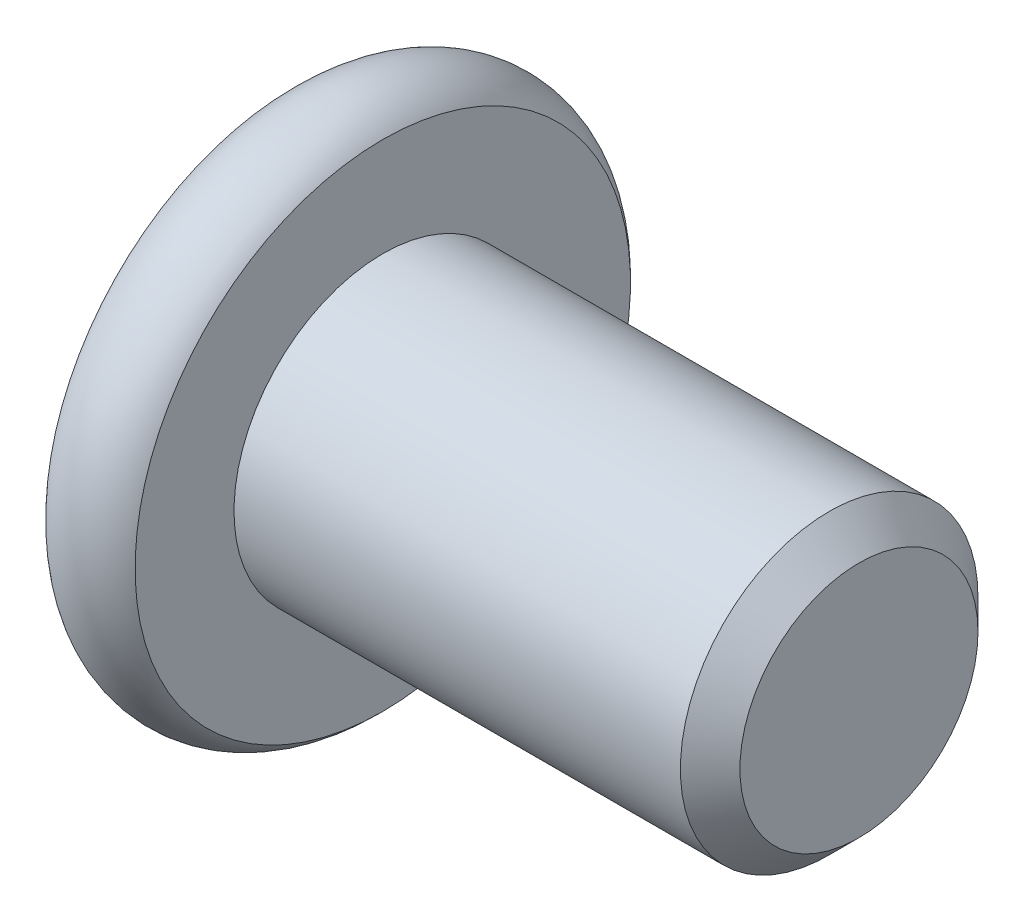
ISO-10303-21;
HEADER;
FILE_DESCRIPTION(('STEP AP214'),'2;1');
FILE_NAME('part.step','',(''),(''),'','','');
FILE_SCHEMA(('AUTOMOTIVE_DESIGN { 1 0 10303 214 1 1 1 1 }'));
ENDSEC;
DATA;
#1=APPLICATION_CONTEXT('core data for automotive mechanical design processes');
#2=APPLICATION_PROTOCOL_DEFINITION('international standard','automotive_design',2000,#1);
#3=PRODUCT_CONTEXT('',#1,'mechanical');
#4=PRODUCT('Part','Part','',(#3));
#5=PRODUCT_RELATED_PRODUCT_CATEGORY('part','',(#4));
#6=PRODUCT_DEFINITION_FORMATION('','',#4);
#7=PRODUCT_DEFINITION_CONTEXT('part definition',#1,'design');
#8=PRODUCT_DEFINITION('design','',#6,#7);
#9=PRODUCT_DEFINITION_SHAPE('','',#8);
#10=(LENGTH_UNIT() NAMED_UNIT(*) SI_UNIT(.MILLI.,.METRE.));
#11=(NAMED_UNIT(*) PLANE_ANGLE_UNIT() SI_UNIT($,.RADIAN.));
#12=(NAMED_UNIT(*) SI_UNIT($,.STERADIAN.) SOLID_ANGLE_UNIT());
#13=UNCERTAINTY_MEASURE_WITH_UNIT(LENGTH_MEASURE(1.E-05),#10,'distance_accuracy_value','');
#14=(GEOMETRIC_REPRESENTATION_CONTEXT(3) GLOBAL_UNCERTAINTY_ASSIGNED_CONTEXT((#13)) GLOBAL_UNIT_ASSIGNED_CONTEXT((#10,
#11,#12)) REPRESENTATION_CONTEXT('',''));
#15=CARTESIAN_POINT('',(0.,0.,0.));
#16=DIRECTION('',(0.,0.,1.));
#17=DIRECTION('',(1.,0.,0.));
#18=AXIS2_PLACEMENT_3D('',#15,#16,#17);
#19=CARTESIAN_POINT('',(-8.,0.,0.));
#20=DIRECTION('',(1.,0.,0.));
#21=DIRECTION('',(0.,0.,-1.));
#22=AXIS2_PLACEMENT_3D('',#19,#20,#21);
#23=CYLINDRICAL_SURFACE('',#22,2.5);
#24=CARTESIAN_POINT('',(-0.500000000000003,0.,0.));
#25=DIRECTION('',(1.,0.,0.));
#26=DIRECTION('',(0.,0.,-1.));
#27=AXIS2_PLACEMENT_3D('',#24,#25,#26);
#28=CIRCLE('',#27,2.5);
#29=CARTESIAN_POINT('',(-0.500000000000003,0.,-2.5));
#30=VERTEX_POINT('',#29);
#31=EDGE_CURVE('E45',#30,#30,#28,.F.);
#32=ORIENTED_EDGE('',*,*,#31,.T.);
#33=EDGE_LOOP('',(#32));
#34=FACE_BOUND('',#33,.T.);
#35=CARTESIAN_POINT('',(-8.,0.,0.));
#36=DIRECTION('',(1.,0.,0.));
#37=DIRECTION('',(0.,1.,0.));
#38=AXIS2_PLACEMENT_3D('',#35,#36,#37);
#39=CIRCLE('',#38,2.5);
#40=CARTESIAN_POINT('',(-8.,2.49999999999999,0.));
#41=VERTEX_POINT('',#40);
#42=EDGE_CURVE('E121',#41,#41,#39,.F.);
#43=ORIENTED_EDGE('',*,*,#42,.F.);
#44=EDGE_LOOP('',(#43));
#45=FACE_BOUND('',#44,.T.);
#46=ADVANCED_FACE('F32',(#34,#45),#23,.T.);
#47=CARTESIAN_POINT('',(0.,0.,0.));
#48=DIRECTION('',(1.,0.,0.));
#49=DIRECTION('',(0.,0.,-1.));
#50=AXIS2_PLACEMENT_3D('',#47,#48,#49);
#51=PLANE('',#50);
#52=CARTESIAN_POINT('',(0.,0.,0.));
#53=DIRECTION('',(1.,0.,0.));
#54=DIRECTION('',(0.,0.,-1.));
#55=AXIS2_PLACEMENT_3D('',#52,#53,#54);
#56=CIRCLE('',#55,2.);
#57=CARTESIAN_POINT('',(0.,0.,-2.));
#58=VERTEX_POINT('',#57);
#59=EDGE_CURVE('E124',#58,#58,#56,.T.);
#60=ORIENTED_EDGE('',*,*,#59,.T.);
#61=EDGE_LOOP('',(#60));
#62=FACE_BOUND('',#61,.T.);
#63=ADVANCED_FACE('F134',(#62),#51,.T.);
#64=CARTESIAN_POINT('',(0.,0.,0.));
#65=DIRECTION('',(-1.,0.,0.));
#66=DIRECTION('',(0.,0.,1.));
#67=AXIS2_PLACEMENT_3D('',#64,#65,#66);
#68=CONICAL_SURFACE('',#67,2.,0.785398163397447);
#69=ORIENTED_EDGE('',*,*,#31,.F.);
#70=EDGE_LOOP('',(#69));
#71=FACE_BOUND('',#70,.T.);
#72=ORIENTED_EDGE('',*,*,#59,.F.);
#73=EDGE_LOOP('',(#72));
#74=FACE_BOUND('',#73,.T.);
#75=ADVANCED_FACE('F34',(#71,#74),#68,.T.);
#76=CARTESIAN_POINT('',(-9.5,0.,0.));
#77=DIRECTION('',(-1.,0.,0.));
#78=DIRECTION('',(0.,-1.,0.));
#79=AXIS2_PLACEMENT_3D('',#76,#77,#78);
#80=PLANE('',#79);
#81=CARTESIAN_POINT('',(-9.5,0.,0.));
#82=DIRECTION('',(-1.,0.,0.));
#83=DIRECTION('',(0.,-1.,0.));
#84=AXIS2_PLACEMENT_3D('',#81,#82,#83);
#85=CIRCLE('',#84,1.78205080756887);
#86=CARTESIAN_POINT('',(-9.50000000000001,-1.78205080756883,0.));
#87=VERTEX_POINT('',#86);
#88=EDGE_CURVE('E234',#87,#87,#85,.T.);
#89=ORIENTED_EDGE('',*,*,#88,.F.);
#90=EDGE_LOOP('',(#89));
#91=FACE_BOUND('',#90,.T.);
#92=CARTESIAN_POINT('',(-9.49999999999999,0.,0.));
#93=DIRECTION('',(1.,0.,0.));
#94=DIRECTION('',(0.,1.,0.));
#95=AXIS2_PLACEMENT_3D('',#92,#93,#94);
#96=CIRCLE('',#95,4.16143782776615);
#97=CARTESIAN_POINT('',(-9.5,4.16143782776615,0.));
#98=VERTEX_POINT('',#97);
#99=EDGE_CURVE('E118',#98,#98,#96,.T.);
#100=ORIENTED_EDGE('',*,*,#99,.F.);
#101=EDGE_LOOP('',(#100));
#102=FACE_BOUND('',#101,.T.);
#103=ADVANCED_FACE('F133',(#91,#102),#80,.T.);
#104=CARTESIAN_POINT('',(-8.75,0.,0.));
#105=DIRECTION('',(1.,0.,0.));
#106=DIRECTION('',(0.,1.,0.));
#107=AXIS2_PLACEMENT_3D('',#104,#105,#106);
#108=TOROIDAL_SURFACE('',#107,3.5,1.);
#109=ORIENTED_EDGE('',*,*,#99,.T.);
#110=EDGE_LOOP('',(#109));
#111=FACE_BOUND('',#110,.T.);
#112=CARTESIAN_POINT('',(-8.,0.,0.));
#113=DIRECTION('',(1.,0.,0.));
#114=DIRECTION('',(0.,1.,0.));
#115=AXIS2_PLACEMENT_3D('',#112,#113,#114);
#116=CIRCLE('',#115,4.16143782776615);
#117=CARTESIAN_POINT('',(-8.,4.16143782776615,0.));
#118=VERTEX_POINT('',#117);
#119=EDGE_CURVE('E115',#118,#118,#116,.T.);
#120=ORIENTED_EDGE('',*,*,#119,.F.);
#121=EDGE_LOOP('',(#120));
#122=FACE_BOUND('',#121,.T.);
#123=ADVANCED_FACE('F145',(#111,#122),#108,.T.);
#124=CARTESIAN_POINT('',(-8.,4.16143782776615,0.));
#125=DIRECTION('',(1.,0.,0.));
#126=DIRECTION('',(0.,1.,0.));
#127=AXIS2_PLACEMENT_3D('',#124,#125,#126);
#128=PLANE('',#127);
#129=ORIENTED_EDGE('',*,*,#42,.T.);
#130=EDGE_LOOP('',(#129));
#131=FACE_BOUND('',#130,.T.);
#132=ORIENTED_EDGE('',*,*,#119,.T.);
#133=EDGE_LOOP('',(#132));
#134=FACE_BOUND('',#133,.T.);
#135=ADVANCED_FACE('F149',(#131,#134),#128,.T.);
#136=CARTESIAN_POINT('',(-9.5,0.,0.));
#137=DIRECTION('',(-1.,0.,0.));
#138=DIRECTION('',(0.,-1.,0.));
#139=AXIS2_PLACEMENT_3D('',#136,#137,#138);
#140=CONICAL_SURFACE('',#139,1.78205080756887,0.78539816339745);
#141=ORIENTED_EDGE('',*,*,#88,.T.);
#142=EDGE_LOOP('',(#141));
#143=FACE_BOUND('',#142,.T.);
#144=CARTESIAN_POINT('',(-10.015428085613,-1.74023253176578,1.5));
#145=CARTESIAN_POINT('',(-9.98338110734452,-1.69791724929732,1.5));
#146=CARTESIAN_POINT('',(-9.95164446728406,-1.65536760966793,1.5));
#147=CARTESIAN_POINT('',(-9.88892039361529,-1.56970398156686,1.5));
#148=CARTESIAN_POINT('',(-9.85793314821998,-1.5265898554285,1.5));
#149=CARTESIAN_POINT('',(-9.76584616434498,-1.39562626326564,1.5));
#150=CARTESIAN_POINT('',(-9.70611451230213,-1.30679868010577,1.5));
#151=CARTESIAN_POINT('',(-9.58873428910123,-1.12044622640216,1.5));
#152=CARTESIAN_POINT('',(-9.53140827748225,-1.02271587306674,1.5));
#153=CARTESIAN_POINT('',(-9.42646321497595,-0.822357214965266,1.5));
#154=CARTESIAN_POINT('',(-9.37881142368962,-0.719746931701929,1.5));
#155=CARTESIAN_POINT('',(-9.32050998831503,-0.565852387095102,1.5));
#156=CARTESIAN_POINT('',(-9.30379905354091,-0.51687419142469,1.5));
#157=CARTESIAN_POINT('',(-9.2743077515089,-0.417723988457528,1.5));
#158=CARTESIAN_POINT('',(-9.26152765142192,-0.367551900263895,1.5));
#159=CARTESIAN_POINT('',(-9.24077842024577,-0.267158299056145,1.5));
#160=CARTESIAN_POINT('',(-9.23272606182593,-0.216954261864881,1.5));
#161=CARTESIAN_POINT('',(-9.22159163683403,-0.115994915871346,1.5));
#162=CARTESIAN_POINT('',(-9.21850868863769,-0.0652397064615639,1.5));
#163=CARTESIAN_POINT('',(-9.21754738974037,0.0344222234875322,1.5));
#164=CARTESIAN_POINT('',(-9.21947892169515,0.0833271701100663,1.5));
#165=CARTESIAN_POINT('',(-9.22801757296766,0.180724293127199,1.5));
#166=CARTESIAN_POINT('',(-9.23462514204802,0.229216429361706,1.5));
#167=CARTESIAN_POINT('',(-9.25226506264468,0.326258027696986,1.5));
#168=CARTESIAN_POINT('',(-9.26337316820096,0.374793507450006,1.5));
#169=CARTESIAN_POINT('',(-9.28941986695951,0.470802295834161,1.5));
#170=CARTESIAN_POINT('',(-9.30435815600349,0.518275688481264,1.5));
#171=CARTESIAN_POINT('',(-9.35683954571596,0.667150562065113,1.5));
#172=CARTESIAN_POINT('',(-9.40033511654416,0.766448362426832,1.5));
#173=CARTESIAN_POINT('',(-9.49705878148361,0.960384405673818,1.5));
#174=CARTESIAN_POINT('',(-9.55032172266746,1.05500437383619,1.5));
#175=CARTESIAN_POINT('',(-9.66022580104533,1.2358452032153,1.5));
#176=CARTESIAN_POINT('',(-9.7165682531046,1.32224986946548,1.5));
#177=CARTESIAN_POINT('',(-9.80367557259701,1.44954953726471,1.5));
#178=CARTESIAN_POINT('',(-9.83301999068387,1.49143368482421,1.5));
#179=CARTESIAN_POINT('',(-9.89248691829305,1.57462914783242,1.5));
#180=CARTESIAN_POINT('',(-9.92260921150072,1.61594061772577,1.5));
#181=CARTESIAN_POINT('',(-9.95305411813654,1.65701358742551,1.5));
#182=B_SPLINE_CURVE_WITH_KNOTS('',3,(#144,#145,#146,#147,#148,#149,#150,#151,#152,#153,#154,
#155,#156,#157,#158,#159,#160,#161,#162,#163,#164,#165,#166,#167,#168,#169,#170,#171,#172,#173,
#174,#175,#176,#177,#178,#179,#180,#181),.UNSPECIFIED.,.F.,.F.,(4,2,2,2,2,2,2,2,2,2,2,2,2,2,2,2,
2,2,4),(0.,0.159238974218355,0.318517535014544,0.639504781932389,0.9791378937992,
1.31760168934357,1.47272233841624,1.62785352839776,1.78016486537347,1.93244917778279,
2.07904486260298,2.22565464958333,2.37484213303399,2.5240177730404,2.84828365283776,
3.1737297566675,3.48303030530537,3.63644667013909,3.78982082222913),.UNSPECIFIED.);
#183=CARTESIAN_POINT('',(-9.45000000000001,-0.866025403784403,1.5));
#184=VERTEX_POINT('',#183);
#185=CARTESIAN_POINT('',(-9.45,0.866025403784475,1.5));
#186=VERTEX_POINT('',#185);
#187=EDGE_CURVE('E99',#184,#186,#182,.T.);
#188=ORIENTED_EDGE('',*,*,#187,.F.);
#189=CARTESIAN_POINT('',(-9.45011548160009,-1.73216627762268,-0.000200000000000452));
#190=CARTESIAN_POINT('',(-9.42036547606734,-1.70239359975911,0.0513677907370754));
#191=CARTESIAN_POINT('',(-9.39236248391033,-1.67212305186351,0.103797917665201));
#192=CARTESIAN_POINT('',(-9.34108923044016,-1.61039789003616,0.210709034055596));
#193=CARTESIAN_POINT('',(-9.31784750504439,-1.5789374031261,0.265200195814661));
#194=CARTESIAN_POINT('',(-9.27803372899223,-1.51549879897984,0.375079081357249));
#195=CARTESIAN_POINT('',(-9.26136158567091,-1.48353684526807,0.4304388090952));
#196=CARTESIAN_POINT('',(-9.23567445681812,-1.41890915196208,0.542377257477151));
#197=CARTESIAN_POINT('',(-9.22664029047888,-1.38624538781115,0.598952556553009));
#198=CARTESIAN_POINT('',(-9.21848908122687,-1.32995210095296,0.696455389516441));
#199=CARTESIAN_POINT('',(-9.21728225298923,-1.3063953331112,0.737256908280466));
#200=CARTESIAN_POINT('',(-9.21931405716228,-1.2593233529019,0.818787969615858));
#201=CARTESIAN_POINT('',(-9.22255367074832,-1.2358081508531,0.85951749431463));
#202=CARTESIAN_POINT('',(-9.23329198598198,-1.18900414978423,0.940584402163416));
#203=CARTESIAN_POINT('',(-9.24079465301875,-1.16571558211716,0.980921384598288));
#204=CARTESIAN_POINT('',(-9.2596516119283,-1.11952932016332,1.06091833691403));
#205=CARTESIAN_POINT('',(-9.2710075570186,-1.09663179808783,1.10057800851621));
#206=CARTESIAN_POINT('',(-9.30472164759268,-1.03798159809695,1.20216313477448));
#207=CARTESIAN_POINT('',(-9.32962184909338,-1.00259267147462,1.26345855370969));
#208=CARTESIAN_POINT('',(-9.37165665327159,-0.950557780604339,1.35358562846331));
#209=CARTESIAN_POINT('',(-9.38642515355911,-0.933410759677112,1.38328513990772));
#210=CARTESIAN_POINT('',(-9.41731056594018,-0.899432101996371,1.44213790138375));
#211=CARTESIAN_POINT('',(-9.43342683412172,-0.882600319285674,1.47129140422064));
#212=CARTESIAN_POINT('',(-9.45011548160008,-0.865909933730565,1.5002));
#213=B_SPLINE_CURVE_WITH_KNOTS('',3,(#189,#190,#191,#192,#193,#194,#195,#196,#197,#198,#199,
#200,#201,#202,#203,#204,#205,#206,#207,#208,#209,#210,#211,#212),.UNSPECIFIED.,.F.,.F.,(4,2,2,
2,2,2,2,2,2,2,2,4),(0.,0.199829143693305,0.400822987382389,0.598623720538182,0.79592624018889,
0.937113067959882,1.07833105577193,1.21968061668222,1.36109089931054,1.58570969637565,
1.69770705470963,1.80965120737194),.UNSPECIFIED.);
#214=CARTESIAN_POINT('',(-9.45000000000002,-1.73205080756884,0.));
#215=VERTEX_POINT('',#214);
#216=EDGE_CURVE('E191',#215,#184,#213,.T.);
#217=ORIENTED_EDGE('',*,*,#216,.F.);
#218=CARTESIAN_POINT('',(-9.45011548160008,-0.865909933730564,-1.5002));
#219=CARTESIAN_POINT('',(-9.42036547606734,-0.895682611594129,-1.44863220926292));
#220=CARTESIAN_POINT('',(-9.39236248391033,-0.925953159489728,-1.3962020823348));
#221=CARTESIAN_POINT('',(-9.34108923044015,-0.987678321317087,-1.2892909659444));
#222=CARTESIAN_POINT('',(-9.31784750504438,-1.01913880822714,-1.23479980418534));
#223=CARTESIAN_POINT('',(-9.27803372899223,-1.08257741237341,-1.12492091864275));
#224=CARTESIAN_POINT('',(-9.26136158567091,-1.11453936608518,-1.0695611909048));
#225=CARTESIAN_POINT('',(-9.23567445681812,-1.17916705939117,-0.957622742522849));
#226=CARTESIAN_POINT('',(-9.22664029047888,-1.2118308235421,-0.901047443446991));
#227=CARTESIAN_POINT('',(-9.21848908122687,-1.26812411040029,-0.803544610483559));
#228=CARTESIAN_POINT('',(-9.21728225298923,-1.29168087824204,-0.762743091719534));
#229=CARTESIAN_POINT('',(-9.21931405716228,-1.33875285845135,-0.681212030384142));
#230=CARTESIAN_POINT('',(-9.22255367074832,-1.36226806050015,-0.64048250568537));
#231=CARTESIAN_POINT('',(-9.23329198598198,-1.40907206156901,-0.559415597836584));
#232=CARTESIAN_POINT('',(-9.24079465301875,-1.43236062923609,-0.519078615401712));
#233=CARTESIAN_POINT('',(-9.25965161192831,-1.47854689118993,-0.439081663085969));
#234=CARTESIAN_POINT('',(-9.2710075570186,-1.50144441326542,-0.399421991483792));
#235=CARTESIAN_POINT('',(-9.30472164759269,-1.5600946132563,-0.297836865225516));
#236=CARTESIAN_POINT('',(-9.32962184909338,-1.59548353987863,-0.236541446290312));
#237=CARTESIAN_POINT('',(-9.37165665327159,-1.6475184307489,-0.146414371536688));
#238=CARTESIAN_POINT('',(-9.38642515355911,-1.66466545167613,-0.116714860092283));
#239=CARTESIAN_POINT('',(-9.41731056594018,-1.69864410935687,-0.0578620986162504));
#240=CARTESIAN_POINT('',(-9.43342683412173,-1.71547589206757,-0.0287085957793641));
#241=CARTESIAN_POINT('',(-9.45011548160009,-1.73216627762268,0.00019999999999879));
#242=B_SPLINE_CURVE_WITH_KNOTS('',3,(#218,#219,#220,#221,#222,#223,#224,#225,#226,#227,#228,
#229,#230,#231,#232,#233,#234,#235,#236,#237,#238,#239,#240,#241),.UNSPECIFIED.,.F.,.F.,(4,2,2,
2,2,2,2,2,2,2,2,4),(0.,0.199829143693305,0.400822987382388,0.59862372053818,0.795926240188889,
0.937113067959881,1.07833105577193,1.21968061668222,1.36109089931054,1.58570969637565,
1.69770705470963,1.80965120737193),.UNSPECIFIED.);
#243=CARTESIAN_POINT('',(-9.45000000000001,-0.866025403784402,-1.5));
#244=VERTEX_POINT('',#243);
#245=EDGE_CURVE('E186',#244,#215,#242,.T.);
#246=ORIENTED_EDGE('',*,*,#245,.F.);
#247=CARTESIAN_POINT('',(-10.0154280857208,-1.74023253190811,-1.5));
#248=CARTESIAN_POINT('',(-9.98338110744817,-1.69791724943563,-1.5));
#249=CARTESIAN_POINT('',(-9.95164446738356,-1.65536760980222,-1.5));
#250=CARTESIAN_POINT('',(-9.88892039370652,-1.56970398169306,-1.5));
#251=CARTESIAN_POINT('',(-9.85793314830708,-1.52658985555063,-1.5));
#252=CARTESIAN_POINT('',(-9.76584616441962,-1.39562626337533,-1.5));
#253=CARTESIAN_POINT('',(-9.70611451236851,-1.30679868020699,-1.5));
#254=CARTESIAN_POINT('',(-9.58873428915059,-1.12044622648493,-1.5));
#255=CARTESIAN_POINT('',(-9.53140827752291,-1.02271587313946,-1.5));
#256=CARTESIAN_POINT('',(-9.42646321500052,-0.822357215017054,-1.5));
#257=CARTESIAN_POINT('',(-9.37881142370675,-0.719746931742828,-1.5));
#258=CARTESIAN_POINT('',(-9.32050998832668,-0.565852387127819,-1.5));
#259=CARTESIAN_POINT('',(-9.3037990535528,-0.516874191460854,-1.5));
#260=CARTESIAN_POINT('',(-9.2743077515206,-0.417723988500702,-1.5));
#261=CARTESIAN_POINT('',(-9.26152765143317,-0.367551900310631,-1.5));
#262=CARTESIAN_POINT('',(-9.24077842025532,-0.267158299109892,-1.5));
#263=CARTESIAN_POINT('',(-9.23272606183424,-0.216954261922073,-1.5));
#264=CARTESIAN_POINT('',(-9.22159163683908,-0.115994915935318,-1.5));
#265=CARTESIAN_POINT('',(-9.21850868864072,-0.0652397065288689,-1.5));
#266=CARTESIAN_POINT('',(-9.21754738973878,0.0344222234141582,-1.5));
#267=CARTESIAN_POINT('',(-9.219478921691,0.0833271700339485,-1.5));
#268=CARTESIAN_POINT('',(-9.228017572958,0.180724293045873,-1.5));
#269=CARTESIAN_POINT('',(-9.23462514203542,0.229216429277917,-1.5));
#270=CARTESIAN_POINT('',(-9.25226506262589,0.326258027608331,-1.5));
#271=CARTESIAN_POINT('',(-9.26337316817892,0.374793507358959,-1.5));
#272=CARTESIAN_POINT('',(-9.28941986693092,0.470802295738562,-1.5));
#273=CARTESIAN_POINT('',(-9.30435815597158,0.518275688383507,-1.5));
#274=CARTESIAN_POINT('',(-9.35683954566847,0.667150561946159,-1.5));
#275=CARTESIAN_POINT('',(-9.40033511648235,0.766448362289902,-1.5));
#276=CARTESIAN_POINT('',(-9.49705878139156,0.960384405502316,-1.5));
#277=CARTESIAN_POINT('',(-9.55032172255949,1.0550043736481,-1.5));
#278=CARTESIAN_POINT('',(-9.6602258009069,1.2358452029974,-1.5));
#279=CARTESIAN_POINT('',(-9.71656825295176,1.32224986923424,-1.5));
#280=CARTESIAN_POINT('',(-9.80367557242263,1.44954953701376,-1.5));
#281=CARTESIAN_POINT('',(-9.83301999050237,1.49143368456679,-1.5));
#282=CARTESIAN_POINT('',(-9.89248691809731,1.57462914756209,-1.5));
#283=CARTESIAN_POINT('',(-9.92260921129787,1.615940617449,-1.5));
#284=CARTESIAN_POINT('',(-9.95305411792659,1.65701358714231,-1.5));
#285=B_SPLINE_CURVE_WITH_KNOTS('',3,(#247,#248,#249,#250,#251,#252,#253,#254,#255,#256,#257,
#258,#259,#260,#261,#262,#263,#264,#265,#266,#267,#268,#269,#270,#271,#272,#273,#274,#275,#276,
#277,#278,#279,#280,#281,#282,#283,#284),.UNSPECIFIED.,.F.,.F.,(4,2,2,2,2,2,2,2,2,2,2,2,2,2,2,2,
2,2,4),(0.,0.15923897423548,0.318517535048798,0.639504782001543,0.979137893907512,
1.31760168949067,1.47272233855335,1.62785352852489,1.78016486549104,1.93244917789081,
2.0790448627025,2.22565464967435,2.37484213311585,2.52401777311309,2.8482836528441,
3.17372975660706,3.4830303051878,3.63644666999335,3.78982082205521),.UNSPECIFIED.);
#286=CARTESIAN_POINT('',(-9.45,0.866025403784475,-1.5));
#287=VERTEX_POINT('',#286);
#288=EDGE_CURVE('E52',#287,#244,#285,.F.);
#289=ORIENTED_EDGE('',*,*,#288,.F.);
#290=CARTESIAN_POINT('',(-9.45011548160008,1.73216627762275,0.000200000000000217));
#291=CARTESIAN_POINT('',(-9.42036547606733,1.70239359975919,-0.0513677907370752));
#292=CARTESIAN_POINT('',(-9.39236248391032,1.67212305186359,-0.1037979176652));
#293=CARTESIAN_POINT('',(-9.34108923044015,1.61039789003623,-0.210709034055596));
#294=CARTESIAN_POINT('',(-9.31784750504437,1.57893740312618,-0.265200195814661));
#295=CARTESIAN_POINT('',(-9.27803372899222,1.51549879897991,-0.375079081357249));
#296=CARTESIAN_POINT('',(-9.2613615856709,1.48353684526814,-0.4304388090952));
#297=CARTESIAN_POINT('',(-9.23567445681811,1.41890915196215,-0.54237725747715));
#298=CARTESIAN_POINT('',(-9.22664029047887,1.38624538781122,-0.598952556553008));
#299=CARTESIAN_POINT('',(-9.21848908122685,1.32995210095303,-0.69645538951644));
#300=CARTESIAN_POINT('',(-9.21728225298922,1.30639533311127,-0.737256908280465));
#301=CARTESIAN_POINT('',(-9.21931405716227,1.25932335290197,-0.818787969615857));
#302=CARTESIAN_POINT('',(-9.22255367074831,1.23580815085317,-0.859517494314629));
#303=CARTESIAN_POINT('',(-9.23329198598197,1.1890041497843,-0.940584402163415));
#304=CARTESIAN_POINT('',(-9.24079465301874,1.16571558211723,-0.980921384598288));
#305=CARTESIAN_POINT('',(-9.25965161192829,1.11952932016339,-1.06091833691403));
#306=CARTESIAN_POINT('',(-9.27100755701859,1.0966317980879,-1.10057800851621));
#307=CARTESIAN_POINT('',(-9.30472164759268,1.03798159809702,-1.20216313477448));
#308=CARTESIAN_POINT('',(-9.32962184909337,1.00259267147469,-1.26345855370969));
#309=CARTESIAN_POINT('',(-9.37165665327158,0.950557780604411,-1.35358562846331));
#310=CARTESIAN_POINT('',(-9.3864251535591,0.933410759677184,-1.38328513990772));
#311=CARTESIAN_POINT('',(-9.41731056594018,0.899432101996444,-1.44213790138375));
#312=CARTESIAN_POINT('',(-9.43342683412172,0.882600319285747,-1.47129140422064));
#313=CARTESIAN_POINT('',(-9.45011548160008,0.865909933730638,-1.5002));
#314=B_SPLINE_CURVE_WITH_KNOTS('',3,(#290,#291,#292,#293,#294,#295,#296,#297,#298,#299,#300,
#301,#302,#303,#304,#305,#306,#307,#308,#309,#310,#311,#312,#313),.UNSPECIFIED.,.F.,.F.,(4,2,2,
2,2,2,2,2,2,2,2,4),(0.,0.199829143693304,0.400822987382389,0.598623720538181,0.795926240188888,
0.93711306795988,1.07833105577193,1.21968061668222,1.36109089931054,1.58570969637565,
1.69770705470964,1.80965120737194),.UNSPECIFIED.);
#315=CARTESIAN_POINT('',(-9.45,1.73205080756891,0.));
#316=VERTEX_POINT('',#315);
#317=EDGE_CURVE('E11',#316,#287,#314,.T.);
#318=ORIENTED_EDGE('',*,*,#317,.F.);
#319=CARTESIAN_POINT('',(-9.45011548160008,0.865909933730637,1.5002));
#320=CARTESIAN_POINT('',(-9.42036547606733,0.895682611594202,1.44863220926292));
#321=CARTESIAN_POINT('',(-9.39236248391032,0.925953159489801,1.3962020823348));
#322=CARTESIAN_POINT('',(-9.34108923044015,0.987678321317159,1.2892909659444));
#323=CARTESIAN_POINT('',(-9.31784750504438,1.01913880822721,1.23479980418534));
#324=CARTESIAN_POINT('',(-9.27803372899223,1.08257741237348,1.12492091864275));
#325=CARTESIAN_POINT('',(-9.2613615856709,1.11453936608525,1.0695611909048));
#326=CARTESIAN_POINT('',(-9.23567445681811,1.17916705939124,0.957622742522849));
#327=CARTESIAN_POINT('',(-9.22664029047887,1.21183082354217,0.901047443446991));
#328=CARTESIAN_POINT('',(-9.21848908122686,1.26812411040036,0.803544610483559));
#329=CARTESIAN_POINT('',(-9.21728225298922,1.29168087824211,0.762743091719534));
#330=CARTESIAN_POINT('',(-9.21931405716227,1.33875285845142,0.681212030384142));
#331=CARTESIAN_POINT('',(-9.22255367074831,1.36226806050022,0.64048250568537));
#332=CARTESIAN_POINT('',(-9.23329198598197,1.40907206156909,0.559415597836584));
#333=CARTESIAN_POINT('',(-9.24079465301874,1.43236062923616,0.519078615401712));
#334=CARTESIAN_POINT('',(-9.25965161192829,1.47854689119,0.439081663085969));
#335=CARTESIAN_POINT('',(-9.27100755701859,1.50144441326549,0.399421991483792));
#336=CARTESIAN_POINT('',(-9.30472164759268,1.56009461325637,0.297836865225515));
#337=CARTESIAN_POINT('',(-9.32962184909337,1.5954835398787,0.236541446290311));
#338=CARTESIAN_POINT('',(-9.37165665327158,1.64751843074898,0.146414371536686));
#339=CARTESIAN_POINT('',(-9.3864251535591,1.6646654516762,0.116714860092282));
#340=CARTESIAN_POINT('',(-9.41731056594017,1.69864410935694,0.0578620986162492));
#341=CARTESIAN_POINT('',(-9.43342683412171,1.71547589206764,0.028708595779363));
#342=CARTESIAN_POINT('',(-9.45011548160008,1.73216627762275,-0.000199999999999785));
#343=B_SPLINE_CURVE_WITH_KNOTS('',3,(#319,#320,#321,#322,#323,#324,#325,#326,#327,#328,#329,
#330,#331,#332,#333,#334,#335,#336,#337,#338,#339,#340,#341,#342),.UNSPECIFIED.,.F.,.F.,(4,2,2,
2,2,2,2,2,2,2,2,4),(0.,0.199829143693305,0.400822987382389,0.598623720538181,0.795926240188889,
0.937113067959881,1.07833105577193,1.21968061668222,1.36109089931054,1.58570969637565,
1.69770705470964,1.80965120737194),.UNSPECIFIED.);
#344=EDGE_CURVE('E90',#186,#316,#343,.T.);
#345=ORIENTED_EDGE('',*,*,#344,.F.);
#346=EDGE_LOOP('',(#188,#217,#246,#289,#318,#345));
#347=FACE_BOUND('',#346,.T.);
#348=ADVANCED_FACE('F89',(#143,#347),#140,.F.);
#349=CARTESIAN_POINT('',(-7.2,0.,0.));
#350=DIRECTION('',(-1.,0.,0.));
#351=DIRECTION('',(0.,-1.,0.));
#352=AXIS2_PLACEMENT_3D('',#349,#350,#351);
#353=PLANE('',#352);
#354=DIRECTION('',(0.,0.5,-0.866025403784439));
#355=VECTOR('',#354,1.);
#356=CARTESIAN_POINT('',(-7.19999999999999,0.866025403784466,1.5));
#357=LINE('',#356,#355);
#358=CARTESIAN_POINT('',(-7.19999999999999,0.866025403784466,1.5));
#359=VERTEX_POINT('',#358);
#360=CARTESIAN_POINT('',(-7.19999999999999,1.7320508075689,0.));
#361=VERTEX_POINT('',#360);
#362=EDGE_CURVE('E98',#359,#361,#357,.T.);
#363=ORIENTED_EDGE('',*,*,#362,.T.);
#364=DIRECTION('',(0.,-0.5,-0.866025403784439));
#365=VECTOR('',#364,1.);
#366=CARTESIAN_POINT('',(-7.19999999999999,1.7320508075689,0.));
#367=LINE('',#366,#365);
#368=CARTESIAN_POINT('',(-7.19999999999999,0.866025403784467,-1.5));
#369=VERTEX_POINT('',#368);
#370=EDGE_CURVE('E103',#361,#369,#367,.T.);
#371=ORIENTED_EDGE('',*,*,#370,.T.);
#372=DIRECTION('',(0.,-1.,0.));
#373=VECTOR('',#372,1.);
#374=CARTESIAN_POINT('',(-7.19999999999999,0.866025403784467,-1.5));
#375=LINE('',#374,#373);
#376=CARTESIAN_POINT('',(-7.2,-0.86602540378441,-1.5));
#377=VERTEX_POINT('',#376);
#378=EDGE_CURVE('E216',#369,#377,#375,.T.);
#379=ORIENTED_EDGE('',*,*,#378,.T.);
#380=DIRECTION('',(0.,-0.5,0.866025403784438));
#381=VECTOR('',#380,1.);
#382=CARTESIAN_POINT('',(-7.2,-0.86602540378441,-1.5));
#383=LINE('',#382,#381);
#384=CARTESIAN_POINT('',(-7.2,-1.73205080756885,0.));
#385=VERTEX_POINT('',#384);
#386=EDGE_CURVE('E220',#377,#385,#383,.T.);
#387=ORIENTED_EDGE('',*,*,#386,.T.);
#388=DIRECTION('',(0.,0.5,0.866025403784439));
#389=VECTOR('',#388,1.);
#390=CARTESIAN_POINT('',(-7.2,-1.73205080756885,0.));
#391=LINE('',#390,#389);
#392=CARTESIAN_POINT('',(-7.2,-0.866025403784411,1.5));
#393=VERTEX_POINT('',#392);
#394=EDGE_CURVE('E111',#385,#393,#391,.T.);
#395=ORIENTED_EDGE('',*,*,#394,.T.);
#396=DIRECTION('',(0.,1.,0.));
#397=VECTOR('',#396,1.);
#398=CARTESIAN_POINT('',(-7.2,-0.866025403784411,1.5));
#399=LINE('',#398,#397);
#400=EDGE_CURVE('E106',#393,#359,#399,.T.);
#401=ORIENTED_EDGE('',*,*,#400,.T.);
#402=EDGE_LOOP('',(#363,#371,#379,#387,#395,#401));
#403=FACE_BOUND('',#402,.T.);
#404=ADVANCED_FACE('F173',(#403),#353,.T.);
#405=CARTESIAN_POINT('',(-7.19999999999999,1.7320508075689,0.));
#406=DIRECTION('',(0.,0.866025403784439,-0.5));
#407=DIRECTION('',(0.,0.5,0.866025403784439));
#408=AXIS2_PLACEMENT_3D('',#405,#406,#407);
#409=PLANE('',#408);
#410=DIRECTION('',(-1.,0.,0.));
#411=VECTOR('',#410,1.);
#412=CARTESIAN_POINT('',(-7.19999999999999,1.7320508075689,0.));
#413=LINE('',#412,#411);
#414=EDGE_CURVE('E96',#361,#316,#413,.T.);
#415=ORIENTED_EDGE('',*,*,#414,.T.);
#416=ORIENTED_EDGE('',*,*,#317,.T.);
#417=DIRECTION('',(-1.,0.,0.));
#418=VECTOR('',#417,1.);
#419=CARTESIAN_POINT('',(-7.19999999999999,0.866025403784467,-1.5));
#420=LINE('',#419,#418);
#421=EDGE_CURVE('E105',#369,#287,#420,.T.);
#422=ORIENTED_EDGE('',*,*,#421,.F.);
#423=ORIENTED_EDGE('',*,*,#370,.F.);
#424=EDGE_LOOP('',(#415,#416,#422,#423));
#425=FACE_BOUND('',#424,.T.);
#426=ADVANCED_FACE('F101',(#425),#409,.F.);
#427=CARTESIAN_POINT('',(-7.19999999999999,0.866025403784467,-1.5));
#428=DIRECTION('',(0.,0.,-1.));
#429=DIRECTION('',(0.,1.,0.));
#430=AXIS2_PLACEMENT_3D('',#427,#428,#429);
#431=PLANE('',#430);
#432=ORIENTED_EDGE('',*,*,#421,.T.);
#433=ORIENTED_EDGE('',*,*,#288,.T.);
#434=DIRECTION('',(-1.,0.,0.));
#435=VECTOR('',#434,1.);
#436=CARTESIAN_POINT('',(-7.2,-0.86602540378441,-1.5));
#437=LINE('',#436,#435);
#438=EDGE_CURVE('E108',#377,#244,#437,.T.);
#439=ORIENTED_EDGE('',*,*,#438,.F.);
#440=ORIENTED_EDGE('',*,*,#378,.F.);
#441=EDGE_LOOP('',(#432,#433,#439,#440));
#442=FACE_BOUND('',#441,.T.);
#443=ADVANCED_FACE('F205',(#442),#431,.F.);
#444=CARTESIAN_POINT('',(-7.2,-0.86602540378441,-1.5));
#445=DIRECTION('',(0.,-0.866025403784438,-0.5));
#446=DIRECTION('',(0.,0.5,-0.866025403784438));
#447=AXIS2_PLACEMENT_3D('',#444,#445,#446);
#448=PLANE('',#447);
#449=ORIENTED_EDGE('',*,*,#438,.T.);
#450=ORIENTED_EDGE('',*,*,#245,.T.);
#451=DIRECTION('',(-1.,0.,0.));
#452=VECTOR('',#451,1.);
#453=CARTESIAN_POINT('',(-7.2,-1.73205080756885,0.));
#454=LINE('',#453,#452);
#455=EDGE_CURVE('E230',#385,#215,#454,.T.);
#456=ORIENTED_EDGE('',*,*,#455,.F.);
#457=ORIENTED_EDGE('',*,*,#386,.F.);
#458=EDGE_LOOP('',(#449,#450,#456,#457));
#459=FACE_BOUND('',#458,.T.);
#460=ADVANCED_FACE('F200',(#459),#448,.F.);
#461=CARTESIAN_POINT('',(-7.2,-1.73205080756885,0.));
#462=DIRECTION('',(0.,-0.866025403784439,0.5));
#463=DIRECTION('',(0.,-0.5,-0.866025403784439));
#464=AXIS2_PLACEMENT_3D('',#461,#462,#463);
#465=PLANE('',#464);
#466=ORIENTED_EDGE('',*,*,#455,.T.);
#467=ORIENTED_EDGE('',*,*,#216,.T.);
#468=DIRECTION('',(-1.,0.,0.));
#469=VECTOR('',#468,1.);
#470=CARTESIAN_POINT('',(-7.2,-0.866025403784411,1.5));
#471=LINE('',#470,#469);
#472=EDGE_CURVE('E227',#393,#184,#471,.T.);
#473=ORIENTED_EDGE('',*,*,#472,.F.);
#474=ORIENTED_EDGE('',*,*,#394,.F.);
#475=EDGE_LOOP('',(#466,#467,#473,#474));
#476=FACE_BOUND('',#475,.T.);
#477=ADVANCED_FACE('F197',(#476),#465,.F.);
#478=CARTESIAN_POINT('',(-7.2,-0.866025403784411,1.5));
#479=DIRECTION('',(0.,0.,1.));
#480=DIRECTION('',(1.,0.,0.));
#481=AXIS2_PLACEMENT_3D('',#478,#479,#480);
#482=PLANE('',#481);
#483=ORIENTED_EDGE('',*,*,#472,.T.);
#484=ORIENTED_EDGE('',*,*,#187,.T.);
#485=DIRECTION('',(-1.,0.,0.));
#486=VECTOR('',#485,1.);
#487=CARTESIAN_POINT('',(-7.19999999999999,0.866025403784466,1.5));
#488=LINE('',#487,#486);
#489=EDGE_CURVE('E59',#359,#186,#488,.T.);
#490=ORIENTED_EDGE('',*,*,#489,.F.);
#491=ORIENTED_EDGE('',*,*,#400,.F.);
#492=EDGE_LOOP('',(#483,#484,#490,#491));
#493=FACE_BOUND('',#492,.T.);
#494=ADVANCED_FACE('F156',(#493),#482,.F.);
#495=CARTESIAN_POINT('',(-7.19999999999999,0.866025403784466,1.5));
#496=DIRECTION('',(0.,0.866025403784439,0.5));
#497=DIRECTION('',(0.,-0.5,0.866025403784439));
#498=AXIS2_PLACEMENT_3D('',#495,#496,#497);
#499=PLANE('',#498);
#500=ORIENTED_EDGE('',*,*,#489,.T.);
#501=ORIENTED_EDGE('',*,*,#344,.T.);
#502=ORIENTED_EDGE('',*,*,#414,.F.);
#503=ORIENTED_EDGE('',*,*,#362,.F.);
#504=EDGE_LOOP('',(#500,#501,#502,#503));
#505=FACE_BOUND('',#504,.T.);
#506=ADVANCED_FACE('F95',(#505),#499,.F.);
#507=CLOSED_SHELL('',(#46,#63,#75,#103,#123,#135,#348,#404,#426,#443,#460,#477,#494,#506));
#508=MANIFOLD_SOLID_BREP('B2',#507);
#509=ADVANCED_BREP_SHAPE_REPRESENTATION('',(#18,#508),#14);
#510=SHAPE_DEFINITION_REPRESENTATION(#9,#509);
ENDSEC;
END-ISO-10303-21;
